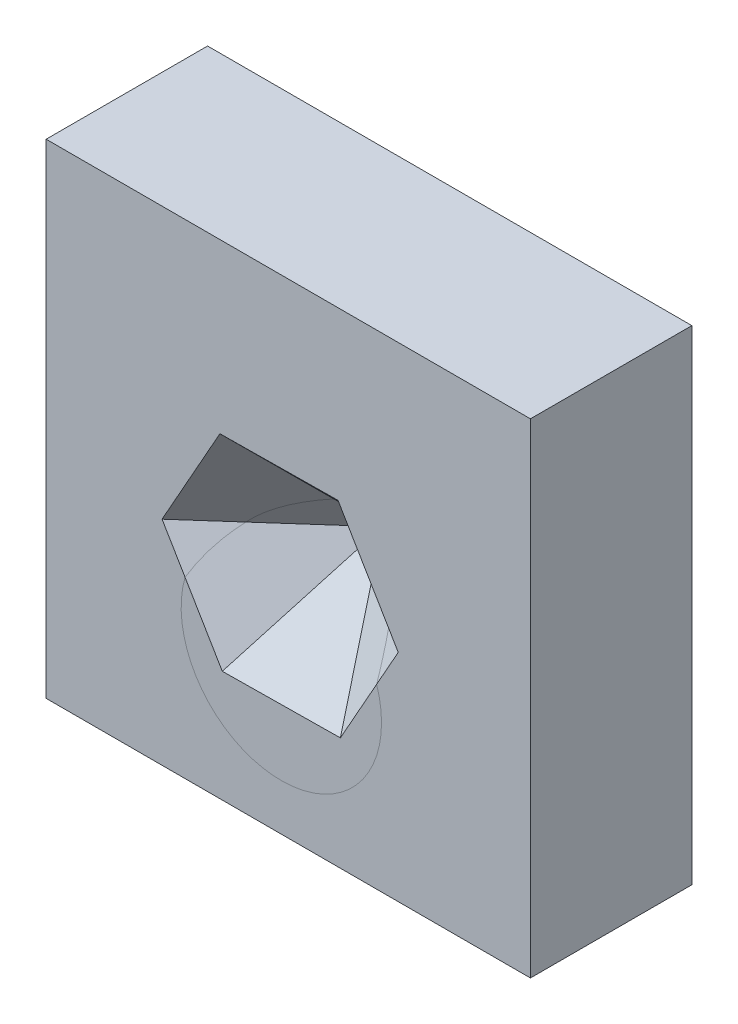
ISO-10303-21;
HEADER;
FILE_DESCRIPTION(('STEP AP214'),'2;1');
FILE_NAME('part.step','',(''),(''),'','','');
FILE_SCHEMA(('AUTOMOTIVE_DESIGN { 1 0 10303 214 1 1 1 1 }'));
ENDSEC;
DATA;
#1=APPLICATION_CONTEXT('core data for automotive mechanical design processes');
#2=APPLICATION_PROTOCOL_DEFINITION('international standard','automotive_design',2000,#1);
#3=PRODUCT_CONTEXT('',#1,'mechanical');
#4=PRODUCT('Part','Part','',(#3));
#5=PRODUCT_RELATED_PRODUCT_CATEGORY('part','',(#4));
#6=PRODUCT_DEFINITION_FORMATION('','',#4);
#7=PRODUCT_DEFINITION_CONTEXT('part definition',#1,'design');
#8=PRODUCT_DEFINITION('design','',#6,#7);
#9=PRODUCT_DEFINITION_SHAPE('','',#8);
#10=(LENGTH_UNIT() NAMED_UNIT(*) SI_UNIT(.MILLI.,.METRE.));
#11=(NAMED_UNIT(*) PLANE_ANGLE_UNIT() SI_UNIT($,.RADIAN.));
#12=(NAMED_UNIT(*) SI_UNIT($,.STERADIAN.) SOLID_ANGLE_UNIT());
#13=UNCERTAINTY_MEASURE_WITH_UNIT(LENGTH_MEASURE(1.E-05),#10,'distance_accuracy_value','');
#14=(GEOMETRIC_REPRESENTATION_CONTEXT(3) GLOBAL_UNCERTAINTY_ASSIGNED_CONTEXT((#13)) GLOBAL_UNIT_ASSIGNED_CONTEXT((#10,
#11,#12)) REPRESENTATION_CONTEXT('',''));
#15=CARTESIAN_POINT('',(0.,0.,0.));
#16=DIRECTION('',(0.,0.,1.));
#17=DIRECTION('',(1.,0.,0.));
#18=AXIS2_PLACEMENT_3D('',#15,#16,#17);
#19=CARTESIAN_POINT('',(91.134960605632,-115.017358177022,0.));
#20=DIRECTION('',(0.616435081002093,-0.346421406541139,-0.707106781186549));
#21=DIRECTION('',(-0.753781698182094,0.,-0.657124913152528));
#22=AXIS2_PLACEMENT_3D('',#19,#20,#21);
#23=PLANE('',#22);
#24=CARTESIAN_POINT('',(72.8460827972074,-104.597895678853,-21.0483495891764));
#25=DIRECTION('',(0.616435081002093,-0.346421406541139,-0.707106781186549));
#26=DIRECTION('',(-0.616435081002095,0.34642140654114,-0.707106781186546));
#27=AXIS2_PLACEMENT_3D('',#24,#25,#26);
#28=ELLIPSE('',#27,43.8860000644244,31.0320882447078);
#29=CARTESIAN_POINT('',(102.36671836745,-95.0311524317365,0.));
#30=VERTEX_POINT('',#29);
#31=CARTESIAN_POINT('',(95.4028022545628,-83.2862812831886,-11.8249141410199));
#32=VERTEX_POINT('',#31);
#33=EDGE_CURVE('E11',#30,#32,#28,.F.);
#34=ORIENTED_EDGE('',*,*,#33,.F.);
#35=DIRECTION('',(0.489913851426844,0.871770851875719,0.));
#36=VECTOR('',#35,1.);
#37=CARTESIAN_POINT('',(91.134960605632,-115.017358177022,0.));
#38=LINE('',#37,#36);
#39=CARTESIAN_POINT('',(109.056117089824,-83.1277885938784,0.));
#40=VERTEX_POINT('',#39);
#41=EDGE_CURVE('E158',#30,#40,#38,.T.);
#42=ORIENTED_EDGE('',*,*,#41,.T.);
#43=DIRECTION('',(0.755878018871128,0.00877450944674579,0.654653670707976));
#44=VECTOR('',#43,1.);
#45=CARTESIAN_POINT('',(98.605329770724,-83.2491051684684,-9.05125709364429));
#46=LINE('',#45,#44);
#47=EDGE_CURVE('E164',#32,#40,#46,.T.);
#48=ORIENTED_EDGE('',*,*,#47,.F.);
#49=EDGE_LOOP('',(#34,#42,#48));
#50=FACE_BOUND('',#49,.T.);
#51=ADVANCED_FACE('F39',(#50),#23,.F.);
#52=CARTESIAN_POINT('',(109.056117089824,-83.1277885938784,0.));
#53=DIRECTION('',(0.60822727898041,0.360637736661161,-0.707106781186549));
#54=DIRECTION('',(-0.758124001973072,0.,-0.652110418282313));
#55=AXIS2_PLACEMENT_3D('',#52,#53,#54);
#56=PLANE('',#55);
#57=CARTESIAN_POINT('',(72.8460827972074,-104.597895678853,-42.0966991783528));
#58=DIRECTION('',(0.60822727898041,0.360637736661161,-0.707106781186549));
#59=DIRECTION('',(-0.608227278980412,-0.360637736661163,-0.707106781186546));
#60=AXIS2_PLACEMENT_3D('',#57,#58,#59);
#61=ELLIPSE('',#60,43.8860000644244,31.0320882447078);
#62=CARTESIAN_POINT('',(77.8613221995551,-73.9737569225637,-22.1638886348878));
#63=VERTEX_POINT('',#62);
#64=EDGE_CURVE('E49',#32,#63,#61,.F.);
#65=ORIENTED_EDGE('',*,*,#64,.F.);
#66=ORIENTED_EDGE('',*,*,#47,.T.);
#67=DIRECTION('',(-0.510018778289752,0.860163266939381,0.));
#68=VECTOR('',#67,1.);
#69=CARTESIAN_POINT('',(109.056117089824,-83.1277885938784,0.));
#70=LINE('',#69,#68);
#71=CARTESIAN_POINT('',(90.3995179571663,-51.6628270218005,0.));
#72=VERTEX_POINT('',#71);
#73=EDGE_CURVE('E143',#40,#72,#70,.T.);
#74=ORIENTED_EDGE('',*,*,#73,.T.);
#75=DIRECTION('',(0.370340061348936,0.658996821228024,0.654653670707976));
#76=VECTOR('',#75,1.);
#77=CARTESIAN_POINT('',(85.2791875331115,-60.7741326169843,-9.05125709364427));
#78=LINE('',#77,#76);
#79=EDGE_CURVE('E139',#63,#72,#78,.T.);
#80=ORIENTED_EDGE('',*,*,#79,.F.);
#81=EDGE_LOOP('',(#65,#66,#74,#80));
#82=FACE_BOUND('',#81,.T.);
#83=ADVANCED_FACE('F252',(#82),#56,.F.);
#84=CARTESIAN_POINT('',(90.3995179571663,-51.6628270218005,0.));
#85=DIRECTION('',(-0.00820780202168335,0.7070591432023,-0.707106781186549));
#86=DIRECTION('',(0.,0.707130600579831,0.707082960990864));
#87=AXIS2_PLACEMENT_3D('',#84,#85,#86);
#88=PLANE('',#87);
#89=CARTESIAN_POINT('',(72.8460827972074,-104.597895678853,-52.7277494169313));
#90=DIRECTION('',(-0.00820780202168335,0.7070591432023,-0.707106781186549));
#91=DIRECTION('',(0.00820780202168338,-0.707059143202303,-0.707106781186546));
#92=AXIS2_PLACEMENT_3D('',#89,#90,#91);
#93=ELLIPSE('',#92,43.8860000644244,31.0320882447078);
#94=CARTESIAN_POINT('',(66.8981362545212,-74.1411651788031,-22.2040295007556));
#95=VERTEX_POINT('',#94);
#96=EDGE_CURVE('E209',#63,#95,#93,.F.);
#97=ORIENTED_EDGE('',*,*,#96,.F.);
#98=ORIENTED_EDGE('',*,*,#79,.T.);
#99=DIRECTION('',(-0.999932629716595,-0.0116075849363379,0.));
#100=VECTOR('',#99,1.);
#101=CARTESIAN_POINT('',(90.3995179571663,-51.6628270218005,0.));
#102=LINE('',#101,#100);
#103=CARTESIAN_POINT('',(53.8217623403169,-52.0874350328658,0.));
#104=VERTEX_POINT('',#103);
#105=EDGE_CURVE('E136',#72,#104,#102,.T.);
#106=ORIENTED_EDGE('',*,*,#105,.T.);
#107=DIRECTION('',(-0.385537957522193,0.650222311781278,0.654653670707976));
#108=VECTOR('',#107,1.);
#109=CARTESIAN_POINT('',(59.152219235362,-61.0774240534595,-9.05125709364428));
#110=LINE('',#109,#108);
#111=EDGE_CURVE('E122',#95,#104,#110,.T.);
#112=ORIENTED_EDGE('',*,*,#111,.F.);
#113=EDGE_LOOP('',(#97,#98,#106,#112));
#114=FACE_BOUND('',#113,.T.);
#115=ADVANCED_FACE('F137',(#114),#88,.F.);
#116=CARTESIAN_POINT('',(53.8217623403169,-52.0874350328658,0.));
#117=DIRECTION('',(-0.616435081002093,0.346421406541139,-0.707106781186549));
#118=DIRECTION('',(-0.753781698182094,0.,0.657124913152528));
#119=AXIS2_PLACEMENT_3D('',#116,#117,#118);
#120=PLANE('',#119);
#121=CARTESIAN_POINT('',(72.8460827972074,-104.597895678853,-42.3104500663333));
#122=DIRECTION('',(-0.616435081002093,0.346421406541139,-0.707106781186549));
#123=DIRECTION('',(0.616435081002095,-0.34642140654114,-0.707106781186546));
#124=AXIS2_PLACEMENT_3D('',#121,#122,#123);
#125=ELLIPSE('',#124,43.8860000644244,31.0320882447078);
#126=CARTESIAN_POINT('',(49.8007223285998,-83.8156469627188,-12.0386650290003));
#127=VERTEX_POINT('',#126);
#128=EDGE_CURVE('E129',#95,#127,#125,.F.);
#129=ORIENTED_EDGE('',*,*,#128,.F.);
#130=ORIENTED_EDGE('',*,*,#111,.T.);
#131=DIRECTION('',(-0.489913851426843,-0.871770851875719,0.));
#132=VECTOR('',#131,1.);
#133=CARTESIAN_POINT('',(53.8217623403169,-52.0874350328658,0.));
#134=LINE('',#133,#132);
#135=CARTESIAN_POINT('',(35.9006058561251,-83.9770046160089,0.));
#136=VERTEX_POINT('',#135);
#137=EDGE_CURVE('E127',#104,#136,#134,.T.);
#138=ORIENTED_EDGE('',*,*,#137,.T.);
#139=DIRECTION('',(-0.755878018871128,-0.00877450944674574,0.654653670707976));
#140=VECTOR('',#139,1.);
#141=CARTESIAN_POINT('',(46.351393175225,-83.8556880414188,-9.05125709364427));
#142=LINE('',#141,#140);
#143=EDGE_CURVE('E167',#127,#136,#142,.T.);
#144=ORIENTED_EDGE('',*,*,#143,.F.);
#145=EDGE_LOOP('',(#129,#130,#138,#144));
#146=FACE_BOUND('',#145,.T.);
#147=ADVANCED_FACE('F124',(#146),#120,.F.);
#148=CARTESIAN_POINT('',(35.9006058561251,-83.9770046160089,0.));
#149=DIRECTION('',(-0.60822727898041,-0.360637736661161,-0.707106781186549));
#150=DIRECTION('',(-0.758124001973072,0.,0.652110418282313));
#151=AXIS2_PLACEMENT_3D('',#148,#149,#150);
#152=PLANE('',#151);
#153=CARTESIAN_POINT('',(72.8460827972074,-104.597895678853,-21.2621004771568));
#154=DIRECTION('',(-0.60822727898041,-0.360637736661161,-0.707106781186549));
#155=DIRECTION('',(0.608227278980412,0.360637736661163,-0.707106781186546));
#156=AXIS2_PLACEMENT_3D('',#153,#154,#155);
#157=ELLIPSE('',#156,43.8860000644244,31.0320882447078);
#158=CARTESIAN_POINT('',(43.0290477476413,-95.9993538443163,0.));
#159=VERTEX_POINT('',#158);
#160=EDGE_CURVE('E213',#127,#159,#157,.F.);
#161=ORIENTED_EDGE('',*,*,#160,.F.);
#162=ORIENTED_EDGE('',*,*,#143,.T.);
#163=DIRECTION('',(0.510018778289752,-0.860163266939381,0.));
#164=VECTOR('',#163,1.);
#165=CARTESIAN_POINT('',(35.9006058561251,-83.9770046160089,0.));
#166=LINE('',#165,#164);
#167=EDGE_CURVE('E149',#136,#159,#166,.T.);
#168=ORIENTED_EDGE('',*,*,#167,.T.);
#169=EDGE_LOOP('',(#161,#162,#168));
#170=FACE_BOUND('',#169,.T.);
#171=ADVANCED_FACE('F231',(#170),#152,.F.);
#172=CARTESIAN_POINT('',(0.,0.,0.));
#173=DIRECTION('',(0.,0.,1.));
#174=DIRECTION('',(1.,0.,0.));
#175=AXIS2_PLACEMENT_3D('',#172,#173,#174);
#176=PLANE('',#175);
#177=DIRECTION('',(0.,-1.,0.));
#178=VECTOR('',#177,1.);
#179=CARTESIAN_POINT('',(0.,0.,0.));
#180=LINE('',#179,#178);
#181=CARTESIAN_POINT('',(0.,0.,0.));
#182=VERTEX_POINT('',#181);
#183=CARTESIAN_POINT('',(0.,-150.,0.));
#184=VERTEX_POINT('',#183);
#185=EDGE_CURVE('E163',#182,#184,#180,.T.);
#186=ORIENTED_EDGE('',*,*,#185,.T.);
#187=DIRECTION('',(1.,0.,0.));
#188=VECTOR('',#187,1.);
#189=CARTESIAN_POINT('',(0.,-150.,0.));
#190=LINE('',#189,#188);
#191=CARTESIAN_POINT('',(150.,-150.,0.));
#192=VERTEX_POINT('',#191);
#193=EDGE_CURVE('E192',#184,#192,#190,.T.);
#194=ORIENTED_EDGE('',*,*,#193,.T.);
#195=DIRECTION('',(0.,1.,0.));
#196=VECTOR('',#195,1.);
#197=CARTESIAN_POINT('',(150.,0.,0.));
#198=LINE('',#197,#196);
#199=CARTESIAN_POINT('',(150.,0.,0.));
#200=VERTEX_POINT('',#199);
#201=EDGE_CURVE('E195',#192,#200,#198,.T.);
#202=ORIENTED_EDGE('',*,*,#201,.T.);
#203=DIRECTION('',(-1.,0.,0.));
#204=VECTOR('',#203,1.);
#205=CARTESIAN_POINT('',(0.,0.,0.));
#206=LINE('',#205,#204);
#207=EDGE_CURVE('E180',#200,#182,#206,.T.);
#208=ORIENTED_EDGE('',*,*,#207,.T.);
#209=EDGE_LOOP('',(#186,#194,#202,#208));
#210=FACE_BOUND('',#209,.T.);
#211=ORIENTED_EDGE('',*,*,#41,.F.);
#212=CARTESIAN_POINT('',(72.8460827972074,-104.597895678853,0.));
#213=DIRECTION('',(0.,0.,1.));
#214=DIRECTION('',(1.,0.,0.));
#215=AXIS2_PLACEMENT_3D('',#212,#213,#214);
#216=CIRCLE('',#215,31.0320882447078);
#217=EDGE_CURVE('E43',#30,#159,#216,.F.);
#218=ORIENTED_EDGE('',*,*,#217,.T.);
#219=ORIENTED_EDGE('',*,*,#167,.F.);
#220=ORIENTED_EDGE('',*,*,#137,.F.);
#221=ORIENTED_EDGE('',*,*,#105,.F.);
#222=ORIENTED_EDGE('',*,*,#73,.F.);
#223=EDGE_LOOP('',(#211,#218,#219,#220,#221,#222));
#224=FACE_BOUND('',#223,.T.);
#225=ADVANCED_FACE('F146',(#210,#224),#176,.T.);
#226=CARTESIAN_POINT('',(0.,0.,-50.));
#227=DIRECTION('',(-1.,0.,0.));
#228=DIRECTION('',(0.,-1.,0.));
#229=AXIS2_PLACEMENT_3D('',#226,#227,#228);
#230=PLANE('',#229);
#231=ORIENTED_EDGE('',*,*,#185,.F.);
#232=DIRECTION('',(0.,0.,1.));
#233=VECTOR('',#232,1.);
#234=CARTESIAN_POINT('',(0.,0.,-50.));
#235=LINE('',#234,#233);
#236=CARTESIAN_POINT('',(0.,0.,-50.));
#237=VERTEX_POINT('',#236);
#238=EDGE_CURVE('E200',#237,#182,#235,.T.);
#239=ORIENTED_EDGE('',*,*,#238,.F.);
#240=DIRECTION('',(0.,-1.,0.));
#241=VECTOR('',#240,1.);
#242=CARTESIAN_POINT('',(0.,0.,-50.));
#243=LINE('',#242,#241);
#244=CARTESIAN_POINT('',(0.,-150.,-50.));
#245=VERTEX_POINT('',#244);
#246=EDGE_CURVE('E176',#237,#245,#243,.T.);
#247=ORIENTED_EDGE('',*,*,#246,.T.);
#248=DIRECTION('',(0.,0.,1.));
#249=VECTOR('',#248,1.);
#250=CARTESIAN_POINT('',(0.,-150.,-50.));
#251=LINE('',#250,#249);
#252=EDGE_CURVE('E189',#245,#184,#251,.T.);
#253=ORIENTED_EDGE('',*,*,#252,.T.);
#254=EDGE_LOOP('',(#231,#239,#247,#253));
#255=FACE_BOUND('',#254,.T.);
#256=ADVANCED_FACE('F41',(#255),#230,.T.);
#257=CARTESIAN_POINT('',(0.,0.,-50.));
#258=DIRECTION('',(0.,1.,0.));
#259=DIRECTION('',(0.,0.,1.));
#260=AXIS2_PLACEMENT_3D('',#257,#258,#259);
#261=PLANE('',#260);
#262=ORIENTED_EDGE('',*,*,#207,.F.);
#263=DIRECTION('',(0.,0.,1.));
#264=VECTOR('',#263,1.);
#265=CARTESIAN_POINT('',(150.,0.,-50.));
#266=LINE('',#265,#264);
#267=CARTESIAN_POINT('',(150.,0.,-50.));
#268=VERTEX_POINT('',#267);
#269=EDGE_CURVE('E202',#268,#200,#266,.T.);
#270=ORIENTED_EDGE('',*,*,#269,.F.);
#271=DIRECTION('',(-1.,0.,0.));
#272=VECTOR('',#271,1.);
#273=CARTESIAN_POINT('',(0.,0.,-50.));
#274=LINE('',#273,#272);
#275=EDGE_CURVE('E186',#268,#237,#274,.T.);
#276=ORIENTED_EDGE('',*,*,#275,.T.);
#277=ORIENTED_EDGE('',*,*,#238,.T.);
#278=EDGE_LOOP('',(#262,#270,#276,#277));
#279=FACE_BOUND('',#278,.T.);
#280=ADVANCED_FACE('F267',(#279),#261,.T.);
#281=CARTESIAN_POINT('',(150.,0.,-50.));
#282=DIRECTION('',(1.,0.,0.));
#283=DIRECTION('',(0.,1.,0.));
#284=AXIS2_PLACEMENT_3D('',#281,#282,#283);
#285=PLANE('',#284);
#286=ORIENTED_EDGE('',*,*,#201,.F.);
#287=DIRECTION('',(0.,0.,1.));
#288=VECTOR('',#287,1.);
#289=CARTESIAN_POINT('',(150.,-150.,-50.));
#290=LINE('',#289,#288);
#291=CARTESIAN_POINT('',(150.,-150.,-50.));
#292=VERTEX_POINT('',#291);
#293=EDGE_CURVE('E204',#292,#192,#290,.T.);
#294=ORIENTED_EDGE('',*,*,#293,.F.);
#295=DIRECTION('',(0.,1.,0.));
#296=VECTOR('',#295,1.);
#297=CARTESIAN_POINT('',(150.,0.,-50.));
#298=LINE('',#297,#296);
#299=EDGE_CURVE('E183',#292,#268,#298,.T.);
#300=ORIENTED_EDGE('',*,*,#299,.T.);
#301=ORIENTED_EDGE('',*,*,#269,.T.);
#302=EDGE_LOOP('',(#286,#294,#300,#301));
#303=FACE_BOUND('',#302,.T.);
#304=ADVANCED_FACE('F270',(#303),#285,.T.);
#305=CARTESIAN_POINT('',(0.,-150.,-50.));
#306=DIRECTION('',(0.,-1.,0.));
#307=DIRECTION('',(0.,0.,-1.));
#308=AXIS2_PLACEMENT_3D('',#305,#306,#307);
#309=PLANE('',#308);
#310=ORIENTED_EDGE('',*,*,#193,.F.);
#311=ORIENTED_EDGE('',*,*,#252,.F.);
#312=DIRECTION('',(1.,0.,0.));
#313=VECTOR('',#312,1.);
#314=CARTESIAN_POINT('',(0.,-150.,-50.));
#315=LINE('',#314,#313);
#316=EDGE_CURVE('E179',#245,#292,#315,.T.);
#317=ORIENTED_EDGE('',*,*,#316,.T.);
#318=ORIENTED_EDGE('',*,*,#293,.T.);
#319=EDGE_LOOP('',(#310,#311,#317,#318));
#320=FACE_BOUND('',#319,.T.);
#321=ADVANCED_FACE('F263',(#320),#309,.T.);
#322=CARTESIAN_POINT('',(0.,0.,-50.));
#323=DIRECTION('',(0.,0.,1.));
#324=DIRECTION('',(1.,0.,0.));
#325=AXIS2_PLACEMENT_3D('',#322,#323,#324);
#326=PLANE('',#325);
#327=ORIENTED_EDGE('',*,*,#246,.F.);
#328=ORIENTED_EDGE('',*,*,#275,.F.);
#329=ORIENTED_EDGE('',*,*,#299,.F.);
#330=ORIENTED_EDGE('',*,*,#316,.F.);
#331=EDGE_LOOP('',(#327,#328,#329,#330));
#332=FACE_BOUND('',#331,.T.);
#333=ADVANCED_FACE('F260',(#332),#326,.F.);
#334=ORIENTED_EDGE('',*,*,#217,.F.);
#335=CARTESIAN_POINT('',(91.134960605632,-115.017358177022,0.));
#336=VERTEX_POINT('',#335);
#337=EDGE_CURVE('E159',#336,#30,#38,.T.);
#338=ORIENTED_EDGE('',*,*,#337,.F.);
#339=DIRECTION('',(0.999932629716595,0.0116075849363381,0.));
#340=VECTOR('',#339,1.);
#341=CARTESIAN_POINT('',(54.5572049887827,-115.441966188087,0.));
#342=LINE('',#341,#340);
#343=CARTESIAN_POINT('',(54.5572049887827,-115.441966188087,0.));
#344=VERTEX_POINT('',#343);
#345=EDGE_CURVE('E155',#344,#336,#342,.T.);
#346=ORIENTED_EDGE('',*,*,#345,.F.);
#347=EDGE_CURVE('E150',#159,#344,#166,.T.);
#348=ORIENTED_EDGE('',*,*,#347,.F.);
#349=EDGE_LOOP('',(#334,#338,#346,#348));
#350=FACE_BOUND('',#349,.T.);
#351=ADVANCED_FACE('F228',(#350),#176,.T.);
#352=CARTESIAN_POINT('',(72.4783614729745,-83.5523966049437,-31.6793998277548));
#353=VERTEX_POINT('',#352);
#354=EDGE_CURVE('E161',#353,#32,#46,.T.);
#355=ORIENTED_EDGE('',*,*,#354,.T.);
#356=ORIENTED_EDGE('',*,*,#64,.T.);
#357=EDGE_CURVE('E133',#353,#63,#78,.T.);
#358=ORIENTED_EDGE('',*,*,#357,.F.);
#359=EDGE_LOOP('',(#355,#356,#358));
#360=FACE_BOUND('',#359,.T.);
#361=ADVANCED_FACE('F239',(#360),#56,.F.);
#362=ORIENTED_EDGE('',*,*,#337,.T.);
#363=ORIENTED_EDGE('',*,*,#33,.T.);
#364=ORIENTED_EDGE('',*,*,#354,.F.);
#365=DIRECTION('',(0.385537957522192,-0.650222311781278,0.654653670707976));
#366=VECTOR('',#365,1.);
#367=CARTESIAN_POINT('',(85.804503710587,-106.027369156428,-9.05125709364425));
#368=LINE('',#367,#366);
#369=EDGE_CURVE('E174',#353,#336,#368,.T.);
#370=ORIENTED_EDGE('',*,*,#369,.T.);
#371=EDGE_LOOP('',(#362,#363,#364,#370));
#372=FACE_BOUND('',#371,.T.);
#373=ADVANCED_FACE('F240',(#372),#23,.F.);
#374=CARTESIAN_POINT('',(54.5572049887827,-115.441966188087,0.));
#375=DIRECTION('',(0.0082078020216835,-0.7070591432023,-0.707106781186549));
#376=DIRECTION('',(0.,0.707130600579831,-0.707082960990864));
#377=AXIS2_PLACEMENT_3D('',#374,#375,#376);
#378=PLANE('',#377);
#379=ORIENTED_EDGE('',*,*,#345,.T.);
#380=ORIENTED_EDGE('',*,*,#369,.F.);
#381=DIRECTION('',(-0.370340061348936,-0.658996821228023,0.654653670707976));
#382=VECTOR('',#381,1.);
#383=CARTESIAN_POINT('',(59.6775354128375,-106.330660592903,-9.05125709364428));
#384=LINE('',#383,#382);
#385=EDGE_CURVE('E171',#353,#344,#384,.T.);
#386=ORIENTED_EDGE('',*,*,#385,.T.);
#387=EDGE_LOOP('',(#379,#380,#386));
#388=FACE_BOUND('',#387,.T.);
#389=ADVANCED_FACE('F242',(#388),#378,.F.);
#390=EDGE_CURVE('E168',#353,#127,#142,.T.);
#391=ORIENTED_EDGE('',*,*,#390,.T.);
#392=ORIENTED_EDGE('',*,*,#160,.T.);
#393=ORIENTED_EDGE('',*,*,#347,.T.);
#394=ORIENTED_EDGE('',*,*,#385,.F.);
#395=EDGE_LOOP('',(#391,#392,#393,#394));
#396=FACE_BOUND('',#395,.T.);
#397=ADVANCED_FACE('F233',(#396),#152,.F.);
#398=EDGE_CURVE('E132',#353,#95,#110,.T.);
#399=ORIENTED_EDGE('',*,*,#398,.T.);
#400=ORIENTED_EDGE('',*,*,#128,.T.);
#401=ORIENTED_EDGE('',*,*,#390,.F.);
#402=EDGE_LOOP('',(#399,#400,#401));
#403=FACE_BOUND('',#402,.T.);
#404=ADVANCED_FACE('F236',(#403),#120,.F.);
#405=ORIENTED_EDGE('',*,*,#357,.T.);
#406=ORIENTED_EDGE('',*,*,#96,.T.);
#407=ORIENTED_EDGE('',*,*,#398,.F.);
#408=EDGE_LOOP('',(#405,#406,#407));
#409=FACE_BOUND('',#408,.T.);
#410=ADVANCED_FACE('F238',(#409),#88,.F.);
#411=CLOSED_SHELL('',(#51,#83,#115,#147,#171,#225,#256,#280,#304,#321,#333,#351,#361,#373,#389,
#397,#404,#410));
#412=MANIFOLD_SOLID_BREP('B2',#411);
#413=ADVANCED_BREP_SHAPE_REPRESENTATION('',(#18,#412),#14);
#414=SHAPE_DEFINITION_REPRESENTATION(#9,#413);
ENDSEC;
END-ISO-10303-21;
